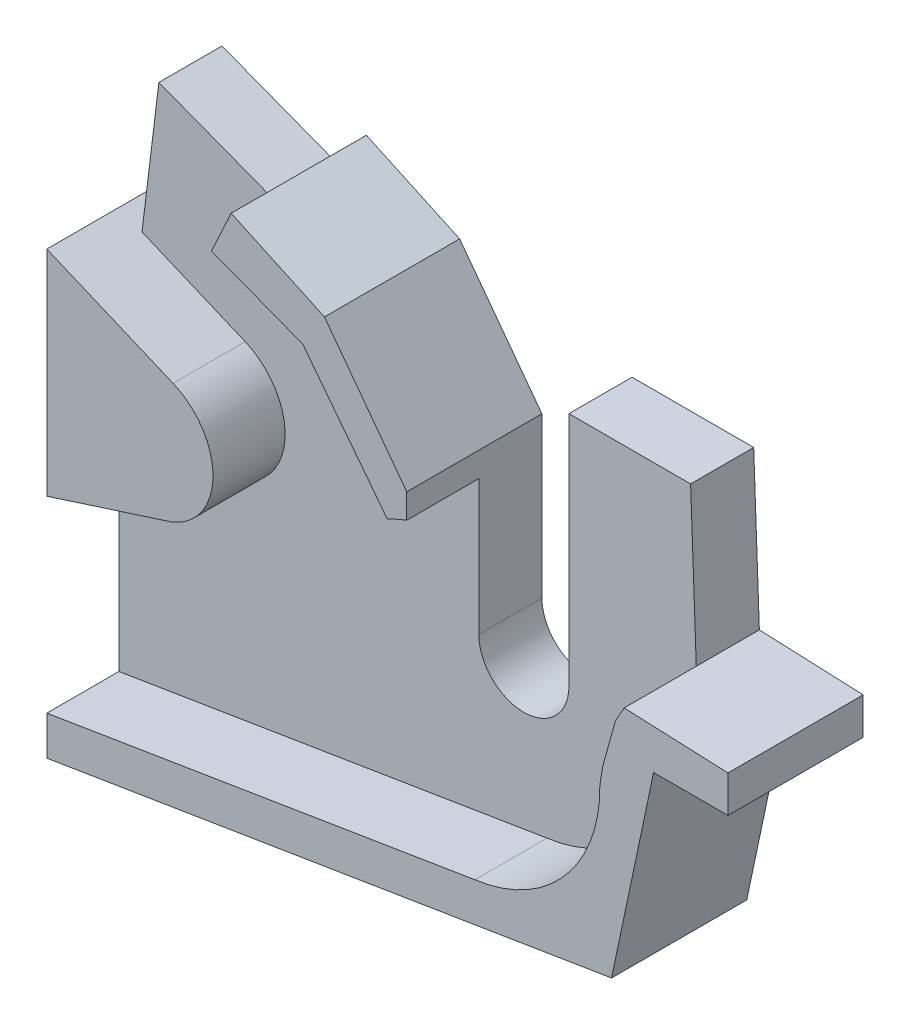
ISO-10303-21;
HEADER;
FILE_DESCRIPTION(('STEP AP214'),'2;1');
FILE_NAME('part.step','',(''),(''),'','','');
FILE_SCHEMA(('AUTOMOTIVE_DESIGN { 1 0 10303 214 1 1 1 1 }'));
ENDSEC;
DATA;
#1=APPLICATION_CONTEXT('core data for automotive mechanical design processes');
#2=APPLICATION_PROTOCOL_DEFINITION('international standard','automotive_design',2000,#1);
#3=PRODUCT_CONTEXT('',#1,'mechanical');
#4=PRODUCT('Part','Part','',(#3));
#5=PRODUCT_RELATED_PRODUCT_CATEGORY('part','',(#4));
#6=PRODUCT_DEFINITION_FORMATION('','',#4);
#7=PRODUCT_DEFINITION_CONTEXT('part definition',#1,'design');
#8=PRODUCT_DEFINITION('design','',#6,#7);
#9=PRODUCT_DEFINITION_SHAPE('','',#8);
#10=(LENGTH_UNIT() NAMED_UNIT(*) SI_UNIT(.MILLI.,.METRE.));
#11=(NAMED_UNIT(*) PLANE_ANGLE_UNIT() SI_UNIT($,.RADIAN.));
#12=(NAMED_UNIT(*) SI_UNIT($,.STERADIAN.) SOLID_ANGLE_UNIT());
#13=UNCERTAINTY_MEASURE_WITH_UNIT(LENGTH_MEASURE(1.E-05),#10,'distance_accuracy_value','');
#14=(GEOMETRIC_REPRESENTATION_CONTEXT(3) GLOBAL_UNCERTAINTY_ASSIGNED_CONTEXT((#13)) GLOBAL_UNIT_ASSIGNED_CONTEXT((#10,
#11,#12)) REPRESENTATION_CONTEXT('',''));
#15=CARTESIAN_POINT('',(0.,0.,0.));
#16=DIRECTION('',(0.,0.,1.));
#17=DIRECTION('',(1.,0.,0.));
#18=AXIS2_PLACEMENT_3D('',#15,#16,#17);
#19=CARTESIAN_POINT('',(0.,0.,7.));
#20=DIRECTION('',(0.,0.,1.));
#21=DIRECTION('',(1.,0.,0.));
#22=AXIS2_PLACEMENT_3D('',#19,#20,#21);
#23=PLANE('',#22);
#24=DIRECTION('',(-0.986991690227506,-0.160771276731423,0.));
#25=VECTOR('',#24,1.);
#26=CARTESIAN_POINT('',(2.22802353362368,-13.6780696031388,7.));
#27=LINE('',#26,#25);
#28=CARTESIAN_POINT('',(6.66593560093297,-12.9551772058192,7.));
#29=VERTEX_POINT('',#28);
#30=CARTESIAN_POINT('',(-40.8439388123938,-20.6940702911495,7.));
#31=VERTEX_POINT('',#30);
#32=EDGE_CURVE('E448',#29,#31,#27,.T.);
#33=ORIENTED_EDGE('',*,*,#32,.F.);
#34=CARTESIAN_POINT('',(4.58668043547776,2.84690158384109,7.));
#35=DIRECTION('',(0.,0.,1.));
#36=DIRECTION('',(1.,0.,0.));
#37=AXIS2_PLACEMENT_3D('',#34,#35,#36);
#38=CIRCLE('',#37,15.9382871136676);
#39=CARTESIAN_POINT('',(20.5233035123729,3.07720795083632,7.));
#40=VERTEX_POINT('',#39);
#41=EDGE_CURVE('E369',#40,#29,#38,.F.);
#42=ORIENTED_EDGE('',*,*,#41,.F.);
#43=DIRECTION('',(0.161052296150216,0.98694587384757,0.));
#44=VECTOR('',#43,1.);
#45=CARTESIAN_POINT('',(19.5018514131188,-3.18236088978088,7.));
#46=LINE('',#45,#44);
#47=CARTESIAN_POINT('',(20.8501257943456,5.0800102106292,7.));
#48=VERTEX_POINT('',#47);
#49=EDGE_CURVE('E374',#40,#48,#46,.T.);
#50=ORIENTED_EDGE('',*,*,#49,.T.);
#51=DIRECTION('',(0.268749678176345,0.963210055221659,0.));
#52=VECTOR('',#51,1.);
#53=CARTESIAN_POINT('',(18.0291728908629,-5.03040264783163,7.));
#54=LINE('',#53,#52);
#55=CARTESIAN_POINT('',(22.2571862666276,10.1229736270083,7.));
#56=VERTEX_POINT('',#55);
#57=EDGE_CURVE('E440',#48,#56,#54,.T.);
#58=ORIENTED_EDGE('',*,*,#57,.T.);
#59=DIRECTION('',(0.491293878545191,0.87099387190957,0.));
#60=VECTOR('',#59,1.);
#61=CARTESIAN_POINT('',(12.553214742302,-7.08078180324617,7.));
#62=LINE('',#61,#60);
#63=CARTESIAN_POINT('',(23.2245967998316,11.83805432074,7.));
#64=VERTEX_POINT('',#63);
#65=EDGE_CURVE('E444',#56,#64,#62,.T.);
#66=ORIENTED_EDGE('',*,*,#65,.T.);
#67=DIRECTION('',(0.0365725060444202,-0.999331002121735,0.));
#68=VECTOR('',#67,1.);
#69=CARTESIAN_POINT('',(23.6261904545896,0.864647440510251,7.));
#70=LINE('',#69,#68);
#71=CARTESIAN_POINT('',(22.5946169567633,29.0520343287084,7.));
#72=VERTEX_POINT('',#71);
#73=EDGE_CURVE('E537',#72,#64,#70,.T.);
#74=ORIENTED_EDGE('',*,*,#73,.F.);
#75=DIRECTION('',(1.,0.,0.));
#76=VECTOR('',#75,1.);
#77=CARTESIAN_POINT('',(0.,29.0520343287084,7.));
#78=LINE('',#77,#76);
#79=CARTESIAN_POINT('',(9.09461695676328,29.0520343287084,7.));
#80=VERTEX_POINT('',#79);
#81=EDGE_CURVE('E541',#80,#72,#78,.T.);
#82=ORIENTED_EDGE('',*,*,#81,.F.);
#83=DIRECTION('',(0.,1.,0.));
#84=VECTOR('',#83,1.);
#85=CARTESIAN_POINT('',(9.09461695676327,0.,7.));
#86=LINE('',#85,#84);
#87=CARTESIAN_POINT('',(9.09461695676328,2.84690158384109,7.));
#88=VERTEX_POINT('',#87);
#89=EDGE_CURVE('E546',#88,#80,#86,.T.);
#90=ORIENTED_EDGE('',*,*,#89,.F.);
#91=CARTESIAN_POINT('',(4.09461695676328,2.84690158384109,7.));
#92=DIRECTION('',(0.,0.,1.));
#93=DIRECTION('',(1.,0.,0.));
#94=AXIS2_PLACEMENT_3D('',#91,#92,#93);
#95=CIRCLE('',#94,5.);
#96=CARTESIAN_POINT('',(-0.905383043236726,2.84690158384109,7.));
#97=VERTEX_POINT('',#96);
#98=EDGE_CURVE('E550',#97,#88,#95,.T.);
#99=ORIENTED_EDGE('',*,*,#98,.F.);
#100=DIRECTION('',(0.,1.,0.));
#101=VECTOR('',#100,1.);
#102=CARTESIAN_POINT('',(-0.905383043236726,0.,7.));
#103=LINE('',#102,#101);
#104=CARTESIAN_POINT('',(-0.905383043236726,17.809061684023,7.));
#105=VERTEX_POINT('',#104);
#106=EDGE_CURVE('E554',#97,#105,#103,.T.);
#107=ORIENTED_EDGE('',*,*,#106,.T.);
#108=CARTESIAN_POINT('',(4.58668043547776,2.84690158384109,7.));
#109=DIRECTION('',(0.,0.,1.));
#110=DIRECTION('',(1.,0.,0.));
#111=AXIS2_PLACEMENT_3D('',#108,#109,#110);
#112=CIRCLE('',#111,15.9382871136676);
#113=CARTESIAN_POINT('',(-3.05448456525014,16.8340954964654,7.));
#114=VERTEX_POINT('',#113);
#115=EDGE_CURVE('E499',#114,#105,#112,.F.);
#116=ORIENTED_EDGE('',*,*,#115,.F.);
#117=DIRECTION('',(-0.612043255233143,0.790824287515007,0.));
#118=VECTOR('',#117,1.);
#119=CARTESIAN_POINT('',(6.23773255920398,4.82757320568069,7.));
#120=LINE('',#119,#118);
#121=CARTESIAN_POINT('',(-12.4513574625302,28.9758440580599,7.));
#122=VERTEX_POINT('',#121);
#123=EDGE_CURVE('E491',#114,#122,#120,.T.);
#124=ORIENTED_EDGE('',*,*,#123,.T.);
#125=DIRECTION('',(-0.934119457751685,0.356960556153896,0.));
#126=VECTOR('',#125,1.);
#127=CARTESIAN_POINT('',(8.07525317413955,21.1318897457754,7.));
#128=LINE('',#127,#126);
#129=CARTESIAN_POINT('',(-22.5723568122106,32.8434409983813,7.));
#130=VERTEX_POINT('',#129);
#131=EDGE_CURVE('E495',#122,#130,#128,.T.);
#132=ORIENTED_EDGE('',*,*,#131,.T.);
#133=DIRECTION('',(0.934119457751685,-0.356960556153896,0.));
#134=VECTOR('',#133,1.);
#135=CARTESIAN_POINT('',(8.07525317413955,21.1318897457754,7.));
#136=LINE('',#135,#134);
#137=CARTESIAN_POINT('',(-36.4119011567542,38.132027383291,7.));
#138=VERTEX_POINT('',#137);
#139=EDGE_CURVE('E558',#138,#130,#136,.T.);
#140=ORIENTED_EDGE('',*,*,#139,.F.);
#141=DIRECTION('',(0.121173466197604,0.99263134702147,0.));
#142=VECTOR('',#141,1.);
#143=CARTESIAN_POINT('',(-40.4638072950435,4.93953752337649,7.));
#144=LINE('',#143,#142);
#145=CARTESIAN_POINT('',(-38.2805029171804,22.8247762110434,7.));
#146=VERTEX_POINT('',#145);
#147=EDGE_CURVE('E562',#146,#138,#144,.T.);
#148=ORIENTED_EDGE('',*,*,#147,.F.);
#149=DIRECTION('',(-0.921598965108976,0.388143462536812,0.));
#150=VECTOR('',#149,1.);
#151=CARTESIAN_POINT('',(2.39754787859476,5.69268287882754,7.));
#152=LINE('',#151,#150);
#153=CARTESIAN_POINT('',(-26.8328210667201,18.003435216013,7.));
#154=VERTEX_POINT('',#153);
#155=EDGE_CURVE('E12',#154,#146,#152,.T.);
#156=ORIENTED_EDGE('',*,*,#155,.F.);
#157=CARTESIAN_POINT('',(-29.6416379067045,11.3342447162123,7.));
#158=DIRECTION('',(0.,0.,1.));
#159=DIRECTION('',(1.,0.,0.));
#160=AXIS2_PLACEMENT_3D('',#157,#158,#159);
#161=CIRCLE('',#160,7.2365429566342);
#162=CARTESIAN_POINT('',(-26.9614499288597,4.6123293369005,7.));
#163=VERTEX_POINT('',#162);
#164=EDGE_CURVE('E676',#154,#163,#161,.F.);
#165=ORIENTED_EDGE('',*,*,#164,.T.);
#166=DIRECTION('',(-0.951986528932336,-0.306139916919311,0.));
#167=VECTOR('',#166,1.);
#168=CARTESIAN_POINT('',(-3.87109376837225,12.0377282283499,7.));
#169=LINE('',#168,#167);
#170=CARTESIAN_POINT('',(-40.8439388123938,0.147997264675908,7.));
#171=VERTEX_POINT('',#170);
#172=EDGE_CURVE('E179',#163,#171,#169,.T.);
#173=ORIENTED_EDGE('',*,*,#172,.T.);
#174=DIRECTION('',(0.,-1.,0.));
#175=VECTOR('',#174,1.);
#176=CARTESIAN_POINT('',(-40.8439388123938,0.,7.));
#177=LINE('',#176,#175);
#178=EDGE_CURVE('E565',#171,#31,#177,.T.);
#179=ORIENTED_EDGE('',*,*,#178,.T.);
#180=EDGE_LOOP('',(#33,#42,#50,#58,#66,#74,#82,#90,#99,#107,#116,#124,#132,#140,#148,#156,#165,
#173,#179));
#181=FACE_BOUND('',#180,.T.);
#182=ADVANCED_FACE('F170',(#181),#23,.T.);
#183=CARTESIAN_POINT('',(23.6261904545896,0.864647440510251,7.));
#184=DIRECTION('',(0.999331002121735,0.0365725060444202,0.));
#185=DIRECTION('',(-0.0365725060444202,0.999331002121735,0.));
#186=AXIS2_PLACEMENT_3D('',#183,#184,#185);
#187=PLANE('',#186);
#188=DIRECTION('',(0.0365725060444202,-0.999331002121735,0.));
#189=VECTOR('',#188,1.);
#190=CARTESIAN_POINT('',(23.6261904545896,0.864647440510251,0.));
#191=LINE('',#190,#189);
#192=CARTESIAN_POINT('',(22.5946169567633,29.0520343287084,0.));
#193=VERTEX_POINT('',#192);
#194=CARTESIAN_POINT('',(23.2245967998316,11.83805432074,0.));
#195=VERTEX_POINT('',#194);
#196=EDGE_CURVE('E573',#193,#195,#191,.T.);
#197=ORIENTED_EDGE('',*,*,#196,.F.);
#198=DIRECTION('',(0.,0.,-1.));
#199=VECTOR('',#198,1.);
#200=CARTESIAN_POINT('',(22.5946169567633,29.0520343287084,7.));
#201=LINE('',#200,#199);
#202=EDGE_CURVE('E670',#72,#193,#201,.T.);
#203=ORIENTED_EDGE('',*,*,#202,.F.);
#204=ORIENTED_EDGE('',*,*,#73,.T.);
#205=DIRECTION('',(0.,0.,-1.));
#206=VECTOR('',#205,1.);
#207=CARTESIAN_POINT('',(23.2245967998316,11.83805432074,7.));
#208=LINE('',#207,#206);
#209=EDGE_CURVE('E673',#64,#195,#208,.T.);
#210=ORIENTED_EDGE('',*,*,#209,.T.);
#211=EDGE_LOOP('',(#197,#203,#204,#210));
#212=FACE_BOUND('',#211,.T.);
#213=ADVANCED_FACE('F788',(#212),#187,.T.);
#214=CARTESIAN_POINT('',(0.,29.0520343287084,7.));
#215=DIRECTION('',(0.,1.,0.));
#216=DIRECTION('',(0.,0.,1.));
#217=AXIS2_PLACEMENT_3D('',#214,#215,#216);
#218=PLANE('',#217);
#219=DIRECTION('',(1.,0.,0.));
#220=VECTOR('',#219,1.);
#221=CARTESIAN_POINT('',(0.,29.0520343287084,0.));
#222=LINE('',#221,#220);
#223=CARTESIAN_POINT('',(9.09461695676328,29.0520343287084,0.));
#224=VERTEX_POINT('',#223);
#225=EDGE_CURVE('E577',#224,#193,#222,.T.);
#226=ORIENTED_EDGE('',*,*,#225,.F.);
#227=DIRECTION('',(0.,0.,-1.));
#228=VECTOR('',#227,1.);
#229=CARTESIAN_POINT('',(9.09461695676328,29.0520343287084,7.));
#230=LINE('',#229,#228);
#231=EDGE_CURVE('E667',#80,#224,#230,.T.);
#232=ORIENTED_EDGE('',*,*,#231,.F.);
#233=ORIENTED_EDGE('',*,*,#81,.T.);
#234=ORIENTED_EDGE('',*,*,#202,.T.);
#235=EDGE_LOOP('',(#226,#232,#233,#234));
#236=FACE_BOUND('',#235,.T.);
#237=ADVANCED_FACE('F728',(#236),#218,.T.);
#238=CARTESIAN_POINT('',(9.09461695676327,0.,7.));
#239=DIRECTION('',(-1.,0.,0.));
#240=DIRECTION('',(0.,-1.,0.));
#241=AXIS2_PLACEMENT_3D('',#238,#239,#240);
#242=PLANE('',#241);
#243=DIRECTION('',(0.,1.,0.));
#244=VECTOR('',#243,1.);
#245=CARTESIAN_POINT('',(9.09461695676327,0.,0.));
#246=LINE('',#245,#244);
#247=CARTESIAN_POINT('',(9.09461695676328,2.84690158384109,0.));
#248=VERTEX_POINT('',#247);
#249=EDGE_CURVE('E581',#248,#224,#246,.T.);
#250=ORIENTED_EDGE('',*,*,#249,.F.);
#251=DIRECTION('',(0.,0.,-1.));
#252=VECTOR('',#251,1.);
#253=CARTESIAN_POINT('',(9.09461695676328,2.84690158384109,7.));
#254=LINE('',#253,#252);
#255=EDGE_CURVE('E664',#88,#248,#254,.T.);
#256=ORIENTED_EDGE('',*,*,#255,.F.);
#257=ORIENTED_EDGE('',*,*,#89,.T.);
#258=ORIENTED_EDGE('',*,*,#231,.T.);
#259=EDGE_LOOP('',(#250,#256,#257,#258));
#260=FACE_BOUND('',#259,.T.);
#261=ADVANCED_FACE('F732',(#260),#242,.T.);
#262=CARTESIAN_POINT('',(4.09461695676328,2.84690158384109,7.));
#263=DIRECTION('',(0.,0.,-1.));
#264=DIRECTION('',(-1.,0.,0.));
#265=AXIS2_PLACEMENT_3D('',#262,#263,#264);
#266=CYLINDRICAL_SURFACE('',#265,5.);
#267=CARTESIAN_POINT('',(4.09461695676328,2.84690158384109,0.));
#268=DIRECTION('',(0.,0.,1.));
#269=DIRECTION('',(1.,0.,0.));
#270=AXIS2_PLACEMENT_3D('',#267,#268,#269);
#271=CIRCLE('',#270,5.);
#272=CARTESIAN_POINT('',(-0.905383043236726,2.84690158384109,0.));
#273=VERTEX_POINT('',#272);
#274=EDGE_CURVE('E585',#273,#248,#271,.T.);
#275=ORIENTED_EDGE('',*,*,#274,.F.);
#276=DIRECTION('',(0.,0.,-1.));
#277=VECTOR('',#276,1.);
#278=CARTESIAN_POINT('',(-0.905383043236726,2.84690158384109,7.));
#279=LINE('',#278,#277);
#280=EDGE_CURVE('E661',#97,#273,#279,.T.);
#281=ORIENTED_EDGE('',*,*,#280,.F.);
#282=ORIENTED_EDGE('',*,*,#98,.T.);
#283=ORIENTED_EDGE('',*,*,#255,.T.);
#284=EDGE_LOOP('',(#275,#281,#282,#283));
#285=FACE_BOUND('',#284,.T.);
#286=ADVANCED_FACE('F736',(#285),#266,.F.);
#287=CARTESIAN_POINT('',(-0.905383043236726,0.,7.));
#288=DIRECTION('',(-1.,0.,0.));
#289=DIRECTION('',(0.,0.,1.));
#290=AXIS2_PLACEMENT_3D('',#287,#288,#289);
#291=PLANE('',#290);
#292=DIRECTION('',(0.,1.,0.));
#293=VECTOR('',#292,1.);
#294=CARTESIAN_POINT('',(-0.905383043236726,0.,0.));
#295=LINE('',#294,#293);
#296=CARTESIAN_POINT('',(-0.905383043236726,20.5391363305154,0.));
#297=VERTEX_POINT('',#296);
#298=EDGE_CURVE('E589',#273,#297,#295,.T.);
#299=ORIENTED_EDGE('',*,*,#298,.T.);
#300=DIRECTION('',(0.,0.,-1.));
#301=VECTOR('',#300,1.);
#302=CARTESIAN_POINT('',(-0.905383043236726,20.5391363305154,7.));
#303=LINE('',#302,#301);
#304=CARTESIAN_POINT('',(-0.905383043236726,20.5391363305154,15.));
#305=VERTEX_POINT('',#304);
#306=EDGE_CURVE('E657',#305,#297,#303,.T.);
#307=ORIENTED_EDGE('',*,*,#306,.F.);
#308=DIRECTION('',(0.,1.,0.));
#309=VECTOR('',#308,1.);
#310=CARTESIAN_POINT('',(-0.905383043236726,0.,15.));
#311=LINE('',#310,#309);
#312=CARTESIAN_POINT('',(-0.905383043236726,17.809061684023,15.));
#313=VERTEX_POINT('',#312);
#314=EDGE_CURVE('E457',#313,#305,#311,.T.);
#315=ORIENTED_EDGE('',*,*,#314,.F.);
#316=DIRECTION('',(0.,0.,-1.));
#317=VECTOR('',#316,1.);
#318=CARTESIAN_POINT('',(-0.905383043236726,17.809061684023,15.));
#319=LINE('',#318,#317);
#320=EDGE_CURVE('E487',#313,#105,#319,.T.);
#321=ORIENTED_EDGE('',*,*,#320,.T.);
#322=ORIENTED_EDGE('',*,*,#106,.F.);
#323=ORIENTED_EDGE('',*,*,#280,.T.);
#324=EDGE_LOOP('',(#299,#307,#315,#321,#322,#323));
#325=FACE_BOUND('',#324,.T.);
#326=ADVANCED_FACE('F740',(#325),#291,.F.);
#327=CARTESIAN_POINT('',(9.26114189402648,6.90647430874386,7.));
#328=DIRECTION('',(-0.801633281882219,-0.597816093275133,0.));
#329=DIRECTION('',(0.597816093275133,-0.801633281882219,0.));
#330=AXIS2_PLACEMENT_3D('',#327,#328,#329);
#331=PLANE('',#330);
#332=DIRECTION('',(-0.597816093275133,0.801633281882219,0.));
#333=VECTOR('',#332,1.);
#334=CARTESIAN_POINT('',(9.26114189402648,6.90647430874386,0.));
#335=LINE('',#334,#333);
#336=CARTESIAN_POINT('',(-10.0368202056355,32.7838116129957,0.));
#337=VERTEX_POINT('',#336);
#338=EDGE_CURVE('E592',#297,#337,#335,.T.);
#339=ORIENTED_EDGE('',*,*,#338,.T.);
#340=DIRECTION('',(0.,0.,-1.));
#341=VECTOR('',#340,1.);
#342=CARTESIAN_POINT('',(-10.0368202056355,32.7838116129957,7.));
#343=LINE('',#342,#341);
#344=CARTESIAN_POINT('',(-10.0368202056355,32.7838116129957,15.));
#345=VERTEX_POINT('',#344);
#346=EDGE_CURVE('E653',#345,#337,#343,.T.);
#347=ORIENTED_EDGE('',*,*,#346,.F.);
#348=DIRECTION('',(-0.597816093275133,0.801633281882219,0.));
#349=VECTOR('',#348,1.);
#350=CARTESIAN_POINT('',(9.26114189402648,6.90647430874386,15.));
#351=LINE('',#350,#349);
#352=EDGE_CURVE('E461',#305,#345,#351,.T.);
#353=ORIENTED_EDGE('',*,*,#352,.F.);
#354=ORIENTED_EDGE('',*,*,#306,.T.);
#355=EDGE_LOOP('',(#339,#347,#353,#354));
#356=FACE_BOUND('',#355,.T.);
#357=ADVANCED_FACE('F787',(#356),#331,.F.);
#358=CARTESIAN_POINT('',(10.7214720768776,23.1841900245257,7.));
#359=DIRECTION('',(-0.419738295272975,-0.907645174879114,0.));
#360=DIRECTION('',(0.907645174879114,-0.419738295272975,0.));
#361=AXIS2_PLACEMENT_3D('',#358,#359,#360);
#362=PLANE('',#361);
#363=DIRECTION('',(-0.907645174879114,0.419738295272975,0.));
#364=VECTOR('',#363,1.);
#365=CARTESIAN_POINT('',(10.7214720768776,23.1841900245257,0.));
#366=LINE('',#365,#364);
#367=CARTESIAN_POINT('',(-20.3865602199569,37.5700236156193,0.));
#368=VERTEX_POINT('',#367);
#369=EDGE_CURVE('E595',#337,#368,#366,.T.);
#370=ORIENTED_EDGE('',*,*,#369,.T.);
#371=DIRECTION('',(0.,0.,-1.));
#372=VECTOR('',#371,1.);
#373=CARTESIAN_POINT('',(-20.3865602199569,37.5700236156193,7.));
#374=LINE('',#373,#372);
#375=CARTESIAN_POINT('',(-20.3865602199569,37.5700236156193,15.));
#376=VERTEX_POINT('',#375);
#377=EDGE_CURVE('E649',#376,#368,#374,.T.);
#378=ORIENTED_EDGE('',*,*,#377,.F.);
#379=DIRECTION('',(-0.907645174879114,0.419738295272975,0.));
#380=VECTOR('',#379,1.);
#381=CARTESIAN_POINT('',(10.7214720768776,23.1841900245257,15.));
#382=LINE('',#381,#380);
#383=EDGE_CURVE('E465',#345,#376,#382,.T.);
#384=ORIENTED_EDGE('',*,*,#383,.F.);
#385=ORIENTED_EDGE('',*,*,#346,.T.);
#386=EDGE_LOOP('',(#370,#378,#384,#385));
#387=FACE_BOUND('',#386,.T.);
#388=ADVANCED_FACE('F783',(#387),#362,.F.);
#389=CARTESIAN_POINT('',(-31.1080322968345,14.3858335910936,7.));
#390=DIRECTION('',(0.907645174879114,-0.419738295272975,0.));
#391=DIRECTION('',(0.419738295272975,0.907645174879114,0.));
#392=AXIS2_PLACEMENT_3D('',#389,#390,#391);
#393=PLANE('',#392);
#394=DIRECTION('',(-0.419738295272975,-0.907645174879114,0.));
#395=VECTOR('',#394,1.);
#396=CARTESIAN_POINT('',(-31.1080322968345,14.3858335910936,0.));
#397=LINE('',#396,#395);
#398=CARTESIAN_POINT('',(-22.5723568122107,32.8434409983813,0.));
#399=VERTEX_POINT('',#398);
#400=EDGE_CURVE('E598',#368,#399,#397,.T.);
#401=ORIENTED_EDGE('',*,*,#400,.T.);
#402=DIRECTION('',(0.,0.,-1.));
#403=VECTOR('',#402,1.);
#404=CARTESIAN_POINT('',(-22.5723568122107,32.8434409983813,7.));
#405=LINE('',#404,#403);
#406=EDGE_CURVE('E646',#130,#399,#405,.T.);
#407=ORIENTED_EDGE('',*,*,#406,.F.);
#408=DIRECTION('',(0.,0.,-1.));
#409=VECTOR('',#408,1.);
#410=CARTESIAN_POINT('',(-22.5723568122106,32.8434409983813,15.));
#411=LINE('',#410,#409);
#412=CARTESIAN_POINT('',(-22.5723568122106,32.8434409983813,15.));
#413=VERTEX_POINT('',#412);
#414=EDGE_CURVE('E484',#413,#130,#411,.T.);
#415=ORIENTED_EDGE('',*,*,#414,.F.);
#416=DIRECTION('',(-0.419738295272975,-0.907645174879114,0.));
#417=VECTOR('',#416,1.);
#418=CARTESIAN_POINT('',(-31.1080322968345,14.3858335910936,15.));
#419=LINE('',#418,#417);
#420=EDGE_CURVE('E469',#376,#413,#419,.T.);
#421=ORIENTED_EDGE('',*,*,#420,.F.);
#422=ORIENTED_EDGE('',*,*,#377,.T.);
#423=EDGE_LOOP('',(#401,#407,#415,#421,#422));
#424=FACE_BOUND('',#423,.T.);
#425=ADVANCED_FACE('F759',(#424),#393,.F.);
#426=CARTESIAN_POINT('',(8.07525317413955,21.1318897457754,7.));
#427=DIRECTION('',(0.356960556153896,0.934119457751685,0.));
#428=DIRECTION('',(-0.934119457751685,0.356960556153896,0.));
#429=AXIS2_PLACEMENT_3D('',#426,#427,#428);
#430=PLANE('',#429);
#431=DIRECTION('',(0.934119457751685,-0.356960556153896,0.));
#432=VECTOR('',#431,1.);
#433=CARTESIAN_POINT('',(8.07525317413955,21.1318897457754,0.));
#434=LINE('',#433,#432);
#435=CARTESIAN_POINT('',(-36.4119011567542,38.132027383291,0.));
#436=VERTEX_POINT('',#435);
#437=EDGE_CURVE('E602',#436,#399,#434,.T.);
#438=ORIENTED_EDGE('',*,*,#437,.F.);
#439=DIRECTION('',(0.,0.,-1.));
#440=VECTOR('',#439,1.);
#441=CARTESIAN_POINT('',(-36.4119011567542,38.132027383291,7.));
#442=LINE('',#441,#440);
#443=EDGE_CURVE('E642',#138,#436,#442,.T.);
#444=ORIENTED_EDGE('',*,*,#443,.F.);
#445=ORIENTED_EDGE('',*,*,#139,.T.);
#446=ORIENTED_EDGE('',*,*,#406,.T.);
#447=EDGE_LOOP('',(#438,#444,#445,#446));
#448=FACE_BOUND('',#447,.T.);
#449=ADVANCED_FACE('F764',(#448),#430,.T.);
#450=CARTESIAN_POINT('',(-40.4638072950435,4.93953752337649,7.));
#451=DIRECTION('',(-0.99263134702147,0.121173466197604,0.));
#452=DIRECTION('',(-0.121173466197604,-0.99263134702147,0.));
#453=AXIS2_PLACEMENT_3D('',#450,#451,#452);
#454=PLANE('',#453);
#455=DIRECTION('',(0.,0.,-1.));
#456=VECTOR('',#455,1.);
#457=CARTESIAN_POINT('',(-38.2805029171804,22.8247762110434,7.));
#458=LINE('',#457,#456);
#459=CARTESIAN_POINT('',(-38.2805029171804,22.8247762110434,0.));
#460=VERTEX_POINT('',#459);
#461=EDGE_CURVE('E533',#146,#460,#458,.T.);
#462=ORIENTED_EDGE('',*,*,#461,.F.);
#463=ORIENTED_EDGE('',*,*,#147,.T.);
#464=ORIENTED_EDGE('',*,*,#443,.T.);
#465=DIRECTION('',(0.121173466197604,0.99263134702147,0.));
#466=VECTOR('',#465,1.);
#467=CARTESIAN_POINT('',(-40.4638072950435,4.93953752337649,0.));
#468=LINE('',#467,#466);
#469=EDGE_CURVE('E606',#460,#436,#468,.T.);
#470=ORIENTED_EDGE('',*,*,#469,.F.);
#471=EDGE_LOOP('',(#462,#463,#464,#470));
#472=FACE_BOUND('',#471,.T.);
#473=ADVANCED_FACE('F768',(#472),#454,.T.);
#474=CARTESIAN_POINT('',(-40.8439388123938,0.,7.));
#475=DIRECTION('',(1.,0.,0.));
#476=DIRECTION('',(0.,0.,-1.));
#477=AXIS2_PLACEMENT_3D('',#474,#475,#476);
#478=PLANE('',#477);
#479=DIRECTION('',(0.,-1.,0.));
#480=VECTOR('',#479,1.);
#481=CARTESIAN_POINT('',(-40.8439388123938,0.,0.));
#482=LINE('',#481,#480);
#483=CARTESIAN_POINT('',(-40.8439388123938,23.9044007788093,0.));
#484=VERTEX_POINT('',#483);
#485=CARTESIAN_POINT('',(-40.8439388123938,-25.025296529904,0.));
#486=VERTEX_POINT('',#485);
#487=EDGE_CURVE('E609',#484,#486,#482,.T.);
#488=ORIENTED_EDGE('',*,*,#487,.T.);
#489=DIRECTION('',(0.,0.,-1.));
#490=VECTOR('',#489,1.);
#491=CARTESIAN_POINT('',(-40.8439388123938,-25.025296529904,7.));
#492=LINE('',#491,#490);
#493=CARTESIAN_POINT('',(-40.8439388123938,-25.025296529904,15.));
#494=VERTEX_POINT('',#493);
#495=EDGE_CURVE('E638',#494,#486,#492,.T.);
#496=ORIENTED_EDGE('',*,*,#495,.F.);
#497=DIRECTION('',(0.,-1.,0.));
#498=VECTOR('',#497,1.);
#499=CARTESIAN_POINT('',(-40.8439388123938,0.,15.));
#500=LINE('',#499,#498);
#501=CARTESIAN_POINT('',(-40.8439388123938,-20.6940702911495,15.));
#502=VERTEX_POINT('',#501);
#503=EDGE_CURVE('E390',#502,#494,#500,.T.);
#504=ORIENTED_EDGE('',*,*,#503,.F.);
#505=DIRECTION('',(0.,0.,-1.));
#506=VECTOR('',#505,1.);
#507=CARTESIAN_POINT('',(-40.8439388123938,-20.6940702911495,15.));
#508=LINE('',#507,#506);
#509=EDGE_CURVE('E375',#502,#31,#508,.T.);
#510=ORIENTED_EDGE('',*,*,#509,.T.);
#511=ORIENTED_EDGE('',*,*,#178,.F.);
#512=DIRECTION('',(0.,0.,-1.));
#513=VECTOR('',#512,1.);
#514=CARTESIAN_POINT('',(-40.8439388123938,0.147997264675908,15.));
#515=LINE('',#514,#513);
#516=CARTESIAN_POINT('',(-40.8439388123938,0.147997264675908,15.));
#517=VERTEX_POINT('',#516);
#518=EDGE_CURVE('E526',#517,#171,#515,.T.);
#519=ORIENTED_EDGE('',*,*,#518,.F.);
#520=DIRECTION('',(0.,-1.,0.));
#521=VECTOR('',#520,1.);
#522=CARTESIAN_POINT('',(-40.8439388123938,0.,15.));
#523=LINE('',#522,#521);
#524=CARTESIAN_POINT('',(-40.8439388123938,23.9044007788093,15.));
#525=VERTEX_POINT('',#524);
#526=EDGE_CURVE('E507',#525,#517,#523,.T.);
#527=ORIENTED_EDGE('',*,*,#526,.F.);
#528=DIRECTION('',(0.,0.,-1.));
#529=VECTOR('',#528,1.);
#530=CARTESIAN_POINT('',(-40.8439388123938,23.9044007788093,15.));
#531=LINE('',#530,#529);
#532=EDGE_CURVE('E529',#525,#484,#531,.T.);
#533=ORIENTED_EDGE('',*,*,#532,.T.);
#534=EDGE_LOOP('',(#488,#496,#504,#510,#511,#519,#527,#533));
#535=FACE_BOUND('',#534,.T.);
#536=ADVANCED_FACE('F689',(#535),#478,.F.);
#537=CARTESIAN_POINT('',(2.9153021414019,-17.8973448899889,7.));
#538=DIRECTION('',(-0.160771276731423,0.986991690227506,0.));
#539=DIRECTION('',(-0.986991690227506,-0.160771276731423,0.));
#540=AXIS2_PLACEMENT_3D('',#537,#538,#539);
#541=PLANE('',#540);
#542=DIRECTION('',(0.986991690227506,0.160771276731423,0.));
#543=VECTOR('',#542,1.);
#544=CARTESIAN_POINT('',(2.9153021414019,-17.8973448899889,0.));
#545=LINE('',#544,#543);
#546=CARTESIAN_POINT('',(21.8226728247008,-14.8175194421297,0.));
#547=VERTEX_POINT('',#546);
#548=EDGE_CURVE('E612',#486,#547,#545,.T.);
#549=ORIENTED_EDGE('',*,*,#548,.T.);
#550=DIRECTION('',(0.,0.,-1.));
#551=VECTOR('',#550,1.);
#552=CARTESIAN_POINT('',(21.8226728247008,-14.8175194421297,7.));
#553=LINE('',#552,#551);
#554=CARTESIAN_POINT('',(21.8226728247008,-14.8175194421297,15.));
#555=VERTEX_POINT('',#554);
#556=EDGE_CURVE('E634',#555,#547,#553,.T.);
#557=ORIENTED_EDGE('',*,*,#556,.F.);
#558=DIRECTION('',(0.986991690227506,0.160771276731423,0.));
#559=VECTOR('',#558,1.);
#560=CARTESIAN_POINT('',(2.9153021414019,-17.8973448899889,15.));
#561=LINE('',#560,#559);
#562=EDGE_CURVE('E393',#494,#555,#561,.T.);
#563=ORIENTED_EDGE('',*,*,#562,.F.);
#564=ORIENTED_EDGE('',*,*,#495,.T.);
#565=EDGE_LOOP('',(#549,#557,#563,#564));
#566=FACE_BOUND('',#565,.T.);
#567=ADVANCED_FACE('F695',(#566),#541,.F.);
#568=CARTESIAN_POINT('',(23.8872555836264,-5.04814442659853,7.));
#569=DIRECTION('',(-0.97839056027552,0.206765353876691,0.));
#570=DIRECTION('',(-0.206765353876691,-0.97839056027552,0.));
#571=AXIS2_PLACEMENT_3D('',#568,#569,#570);
#572=PLANE('',#571);
#573=DIRECTION('',(0.206765353876691,0.97839056027552,0.));
#574=VECTOR('',#573,1.);
#575=CARTESIAN_POINT('',(23.8872555836264,-5.04814442659853,0.));
#576=LINE('',#575,#574);
#577=CARTESIAN_POINT('',(26.4898011963491,7.26681072634678,0.));
#578=VERTEX_POINT('',#577);
#579=EDGE_CURVE('E615',#547,#578,#576,.T.);
#580=ORIENTED_EDGE('',*,*,#579,.T.);
#581=DIRECTION('',(0.,0.,-1.));
#582=VECTOR('',#581,1.);
#583=CARTESIAN_POINT('',(26.4898011963491,7.26681072634678,7.));
#584=LINE('',#583,#582);
#585=CARTESIAN_POINT('',(26.4898011963491,7.26681072634678,15.));
#586=VERTEX_POINT('',#585);
#587=EDGE_CURVE('E630',#586,#578,#584,.T.);
#588=ORIENTED_EDGE('',*,*,#587,.F.);
#589=DIRECTION('',(0.206765353876691,0.97839056027552,0.));
#590=VECTOR('',#589,1.);
#591=CARTESIAN_POINT('',(23.8872555836264,-5.04814442659853,15.));
#592=LINE('',#591,#590);
#593=EDGE_CURVE('E399',#555,#586,#592,.T.);
#594=ORIENTED_EDGE('',*,*,#593,.F.);
#595=ORIENTED_EDGE('',*,*,#556,.T.);
#596=EDGE_LOOP('',(#580,#588,#594,#595));
#597=FACE_BOUND('',#596,.T.);
#598=ADVANCED_FACE('F699',(#597),#572,.F.);
#599=CARTESIAN_POINT('',(0.,7.26681072634678,7.));
#600=DIRECTION('',(0.,1.,0.));
#601=DIRECTION('',(0.,0.,1.));
#602=AXIS2_PLACEMENT_3D('',#599,#600,#601);
#603=PLANE('',#602);
#604=DIRECTION('',(1.,0.,0.));
#605=VECTOR('',#604,1.);
#606=CARTESIAN_POINT('',(0.,7.26681072634678,0.));
#607=LINE('',#606,#605);
#608=CARTESIAN_POINT('',(34.744303122736,7.26681072634678,0.));
#609=VERTEX_POINT('',#608);
#610=EDGE_CURVE('E618',#578,#609,#607,.T.);
#611=ORIENTED_EDGE('',*,*,#610,.T.);
#612=DIRECTION('',(0.,0.,-1.));
#613=VECTOR('',#612,1.);
#614=CARTESIAN_POINT('',(34.744303122736,7.26681072634678,7.));
#615=LINE('',#614,#613);
#616=CARTESIAN_POINT('',(34.744303122736,7.26681072634678,15.));
#617=VERTEX_POINT('',#616);
#618=EDGE_CURVE('E626',#617,#609,#615,.T.);
#619=ORIENTED_EDGE('',*,*,#618,.F.);
#620=DIRECTION('',(1.,0.,0.));
#621=VECTOR('',#620,1.);
#622=CARTESIAN_POINT('',(0.,7.26681072634678,15.));
#623=LINE('',#622,#621);
#624=EDGE_CURVE('E403',#586,#617,#623,.T.);
#625=ORIENTED_EDGE('',*,*,#624,.F.);
#626=ORIENTED_EDGE('',*,*,#587,.T.);
#627=EDGE_LOOP('',(#611,#619,#625,#626));
#628=FACE_BOUND('',#627,.T.);
#629=ADVANCED_FACE('F705',(#628),#603,.F.);
#630=CARTESIAN_POINT('',(34.744303122736,0.,7.));
#631=DIRECTION('',(-1.,0.,0.));
#632=DIRECTION('',(0.,0.,1.));
#633=AXIS2_PLACEMENT_3D('',#630,#631,#632);
#634=PLANE('',#633);
#635=DIRECTION('',(0.,1.,0.));
#636=VECTOR('',#635,1.);
#637=CARTESIAN_POINT('',(34.744303122736,0.,0.));
#638=LINE('',#637,#636);
#639=CARTESIAN_POINT('',(34.744303122736,11.3546415658289,0.));
#640=VERTEX_POINT('',#639);
#641=EDGE_CURVE('E542',#609,#640,#638,.T.);
#642=ORIENTED_EDGE('',*,*,#641,.T.);
#643=DIRECTION('',(0.,0.,-1.));
#644=VECTOR('',#643,1.);
#645=CARTESIAN_POINT('',(34.744303122736,11.3546415658289,7.));
#646=LINE('',#645,#644);
#647=CARTESIAN_POINT('',(34.744303122736,11.3546415658289,15.));
#648=VERTEX_POINT('',#647);
#649=EDGE_CURVE('E569',#648,#640,#646,.T.);
#650=ORIENTED_EDGE('',*,*,#649,.F.);
#651=DIRECTION('',(0.,1.,0.));
#652=VECTOR('',#651,1.);
#653=CARTESIAN_POINT('',(34.744303122736,0.,15.));
#654=LINE('',#653,#652);
#655=EDGE_CURVE('E407',#617,#648,#654,.T.);
#656=ORIENTED_EDGE('',*,*,#655,.F.);
#657=ORIENTED_EDGE('',*,*,#618,.T.);
#658=EDGE_LOOP('',(#642,#650,#656,#657));
#659=FACE_BOUND('',#658,.T.);
#660=ADVANCED_FACE('F709',(#659),#634,.F.);
#661=CARTESIAN_POINT('',(0.536724699134198,12.7901277892678,7.));
#662=DIRECTION('',(0.0419270824807038,0.999120673269579,0.));
#663=DIRECTION('',(-0.999120673269579,0.0419270824807038,0.));
#664=AXIS2_PLACEMENT_3D('',#661,#662,#663);
#665=PLANE('',#664);
#666=DIRECTION('',(0.999120673269579,-0.0419270824807038,0.));
#667=VECTOR('',#666,1.);
#668=CARTESIAN_POINT('',(0.536724699134198,12.7901277892678,0.));
#669=LINE('',#668,#667);
#670=EDGE_CURVE('E536',#195,#640,#669,.T.);
#671=ORIENTED_EDGE('',*,*,#670,.F.);
#672=ORIENTED_EDGE('',*,*,#209,.F.);
#673=DIRECTION('',(0.,0.,-1.));
#674=VECTOR('',#673,1.);
#675=CARTESIAN_POINT('',(23.2245967998316,11.83805432074,15.));
#676=LINE('',#675,#674);
#677=CARTESIAN_POINT('',(23.2245967998316,11.83805432074,15.));
#678=VERTEX_POINT('',#677);
#679=EDGE_CURVE('E432',#678,#64,#676,.T.);
#680=ORIENTED_EDGE('',*,*,#679,.F.);
#681=DIRECTION('',(0.999120673269579,-0.0419270824807038,0.));
#682=VECTOR('',#681,1.);
#683=CARTESIAN_POINT('',(0.536724699134198,12.7901277892678,15.));
#684=LINE('',#683,#682);
#685=EDGE_CURVE('E411',#678,#648,#684,.T.);
#686=ORIENTED_EDGE('',*,*,#685,.T.);
#687=ORIENTED_EDGE('',*,*,#649,.T.);
#688=EDGE_LOOP('',(#671,#672,#680,#686,#687));
#689=FACE_BOUND('',#688,.T.);
#690=ADVANCED_FACE('F172',(#689),#665,.T.);
#691=CARTESIAN_POINT('',(0.,0.,0.));
#692=DIRECTION('',(0.,0.,1.));
#693=DIRECTION('',(1.,0.,0.));
#694=AXIS2_PLACEMENT_3D('',#691,#692,#693);
#695=PLANE('',#694);
#696=ORIENTED_EDGE('',*,*,#548,.F.);
#697=ORIENTED_EDGE('',*,*,#487,.F.);
#698=DIRECTION('',(0.921598965108976,-0.388143462536812,0.));
#699=VECTOR('',#698,1.);
#700=CARTESIAN_POINT('',(2.39754787859476,5.69268287882754,0.));
#701=LINE('',#700,#699);
#702=EDGE_CURVE('E502',#484,#460,#701,.T.);
#703=ORIENTED_EDGE('',*,*,#702,.T.);
#704=ORIENTED_EDGE('',*,*,#469,.T.);
#705=ORIENTED_EDGE('',*,*,#437,.T.);
#706=ORIENTED_EDGE('',*,*,#400,.F.);
#707=ORIENTED_EDGE('',*,*,#369,.F.);
#708=ORIENTED_EDGE('',*,*,#338,.F.);
#709=ORIENTED_EDGE('',*,*,#298,.F.);
#710=ORIENTED_EDGE('',*,*,#274,.T.);
#711=ORIENTED_EDGE('',*,*,#249,.T.);
#712=ORIENTED_EDGE('',*,*,#225,.T.);
#713=ORIENTED_EDGE('',*,*,#196,.T.);
#714=ORIENTED_EDGE('',*,*,#670,.T.);
#715=ORIENTED_EDGE('',*,*,#641,.F.);
#716=ORIENTED_EDGE('',*,*,#610,.F.);
#717=ORIENTED_EDGE('',*,*,#579,.F.);
#718=EDGE_LOOP('',(#696,#697,#703,#704,#705,#706,#707,#708,#709,#710,#711,#712,#713,#714,#715,
#716,#717));
#719=FACE_BOUND('',#718,.T.);
#720=ADVANCED_FACE('F702',(#719),#695,.F.);
#721=CARTESIAN_POINT('',(2.39754787859476,5.69268287882754,15.));
#722=DIRECTION('',(0.388143462536812,0.921598965108975,0.));
#723=DIRECTION('',(-0.921598965108976,0.388143462536812,0.));
#724=AXIS2_PLACEMENT_3D('',#721,#722,#723);
#725=PLANE('',#724);
#726=ORIENTED_EDGE('',*,*,#155,.T.);
#727=ORIENTED_EDGE('',*,*,#461,.T.);
#728=ORIENTED_EDGE('',*,*,#702,.F.);
#729=ORIENTED_EDGE('',*,*,#532,.F.);
#730=DIRECTION('',(0.921598965108976,-0.388143462536812,0.));
#731=VECTOR('',#730,1.);
#732=CARTESIAN_POINT('',(2.39754787859476,5.69268287882754,15.));
#733=LINE('',#732,#731);
#734=CARTESIAN_POINT('',(-26.8328210667201,18.003435216013,15.));
#735=VERTEX_POINT('',#734);
#736=EDGE_CURVE('E503',#525,#735,#733,.T.);
#737=ORIENTED_EDGE('',*,*,#736,.T.);
#738=DIRECTION('',(0.,0.,-1.));
#739=VECTOR('',#738,1.);
#740=CARTESIAN_POINT('',(-26.8328210667201,18.003435216013,15.));
#741=LINE('',#740,#739);
#742=EDGE_CURVE('E516',#735,#154,#741,.T.);
#743=ORIENTED_EDGE('',*,*,#742,.T.);
#744=EDGE_LOOP('',(#726,#727,#728,#729,#737,#743));
#745=FACE_BOUND('',#744,.T.);
#746=ADVANCED_FACE('F770',(#745),#725,.T.);
#747=CARTESIAN_POINT('',(-3.87109376837225,12.0377282283499,15.));
#748=DIRECTION('',(-0.306139916919311,0.951986528932336,0.));
#749=DIRECTION('',(-0.951986528932336,-0.306139916919311,0.));
#750=AXIS2_PLACEMENT_3D('',#747,#748,#749);
#751=PLANE('',#750);
#752=ORIENTED_EDGE('',*,*,#172,.F.);
#753=DIRECTION('',(0.,0.,-1.));
#754=VECTOR('',#753,1.);
#755=CARTESIAN_POINT('',(-26.9614499288597,4.6123293369005,15.));
#756=LINE('',#755,#754);
#757=CARTESIAN_POINT('',(-26.9614499288597,4.6123293369005,15.));
#758=VERTEX_POINT('',#757);
#759=EDGE_CURVE('E523',#758,#163,#756,.T.);
#760=ORIENTED_EDGE('',*,*,#759,.F.);
#761=DIRECTION('',(0.951986528932336,0.306139916919311,0.));
#762=VECTOR('',#761,1.);
#763=CARTESIAN_POINT('',(-3.87109376837225,12.0377282283499,15.));
#764=LINE('',#763,#762);
#765=EDGE_CURVE('E510',#517,#758,#764,.T.);
#766=ORIENTED_EDGE('',*,*,#765,.F.);
#767=ORIENTED_EDGE('',*,*,#518,.T.);
#768=EDGE_LOOP('',(#752,#760,#766,#767));
#769=FACE_BOUND('',#768,.T.);
#770=ADVANCED_FACE('F777',(#769),#751,.F.);
#771=CARTESIAN_POINT('',(-29.6416379067045,11.3342447162123,15.));
#772=DIRECTION('',(0.,0.,-1.));
#773=DIRECTION('',(-1.,0.,0.));
#774=AXIS2_PLACEMENT_3D('',#771,#772,#773);
#775=CYLINDRICAL_SURFACE('',#774,7.2365429566342);
#776=ORIENTED_EDGE('',*,*,#164,.F.);
#777=ORIENTED_EDGE('',*,*,#742,.F.);
#778=CARTESIAN_POINT('',(-29.6416379067045,11.3342447162123,15.));
#779=DIRECTION('',(0.,0.,1.));
#780=DIRECTION('',(1.,0.,0.));
#781=AXIS2_PLACEMENT_3D('',#778,#779,#780);
#782=CIRCLE('',#781,7.2365429566342);
#783=EDGE_CURVE('E513',#758,#735,#782,.T.);
#784=ORIENTED_EDGE('',*,*,#783,.F.);
#785=ORIENTED_EDGE('',*,*,#759,.T.);
#786=EDGE_LOOP('',(#776,#777,#784,#785));
#787=FACE_BOUND('',#786,.T.);
#788=ADVANCED_FACE('F776',(#787),#775,.T.);
#789=CARTESIAN_POINT('',(0.,0.,15.));
#790=DIRECTION('',(0.,0.,1.));
#791=DIRECTION('',(1.,0.,0.));
#792=AXIS2_PLACEMENT_3D('',#789,#790,#791);
#793=PLANE('',#792);
#794=ORIENTED_EDGE('',*,*,#736,.F.);
#795=ORIENTED_EDGE('',*,*,#526,.T.);
#796=ORIENTED_EDGE('',*,*,#765,.T.);
#797=ORIENTED_EDGE('',*,*,#783,.T.);
#798=EDGE_LOOP('',(#794,#795,#796,#797));
#799=FACE_BOUND('',#798,.T.);
#800=ADVANCED_FACE('F779',(#799),#793,.T.);
#801=CARTESIAN_POINT('',(4.58668043547776,2.84690158384109,15.));
#802=DIRECTION('',(0.,0.,-1.));
#803=DIRECTION('',(-1.,0.,0.));
#804=AXIS2_PLACEMENT_3D('',#801,#802,#803);
#805=CYLINDRICAL_SURFACE('',#804,15.9382871136676);
#806=DIRECTION('',(0.,0.,-1.));
#807=VECTOR('',#806,1.);
#808=CARTESIAN_POINT('',(-3.05448456525014,16.8340954964654,15.));
#809=LINE('',#808,#807);
#810=CARTESIAN_POINT('',(-3.05448456525014,16.8340954964654,15.));
#811=VERTEX_POINT('',#810);
#812=EDGE_CURVE('E478',#811,#114,#809,.T.);
#813=ORIENTED_EDGE('',*,*,#812,.T.);
#814=ORIENTED_EDGE('',*,*,#115,.T.);
#815=ORIENTED_EDGE('',*,*,#320,.F.);
#816=CARTESIAN_POINT('',(4.58668043547776,2.84690158384109,15.));
#817=DIRECTION('',(0.,0.,1.));
#818=DIRECTION('',(1.,0.,0.));
#819=AXIS2_PLACEMENT_3D('',#816,#817,#818);
#820=CIRCLE('',#819,15.9382871136676);
#821=EDGE_CURVE('E453',#313,#811,#820,.T.);
#822=ORIENTED_EDGE('',*,*,#821,.T.);
#823=EDGE_LOOP('',(#813,#814,#815,#822));
#824=FACE_BOUND('',#823,.T.);
#825=ADVANCED_FACE('F744',(#824),#805,.F.);
#826=CARTESIAN_POINT('',(8.07525317413955,21.1318897457754,15.));
#827=DIRECTION('',(0.356960556153896,0.934119457751685,0.));
#828=DIRECTION('',(-0.934119457751685,0.356960556153896,0.));
#829=AXIS2_PLACEMENT_3D('',#826,#827,#828);
#830=PLANE('',#829);
#831=ORIENTED_EDGE('',*,*,#131,.F.);
#832=DIRECTION('',(0.,0.,-1.));
#833=VECTOR('',#832,1.);
#834=CARTESIAN_POINT('',(-12.4513574625302,28.9758440580599,15.));
#835=LINE('',#834,#833);
#836=CARTESIAN_POINT('',(-12.4513574625302,28.9758440580599,15.));
#837=VERTEX_POINT('',#836);
#838=EDGE_CURVE('E194',#837,#122,#835,.T.);
#839=ORIENTED_EDGE('',*,*,#838,.F.);
#840=DIRECTION('',(0.934119457751685,-0.356960556153896,0.));
#841=VECTOR('',#840,1.);
#842=CARTESIAN_POINT('',(8.07525317413955,21.1318897457754,15.));
#843=LINE('',#842,#841);
#844=EDGE_CURVE('E472',#413,#837,#843,.T.);
#845=ORIENTED_EDGE('',*,*,#844,.F.);
#846=ORIENTED_EDGE('',*,*,#414,.T.);
#847=EDGE_LOOP('',(#831,#839,#845,#846));
#848=FACE_BOUND('',#847,.T.);
#849=ADVANCED_FACE('F754',(#848),#830,.F.);
#850=CARTESIAN_POINT('',(6.23773255920398,4.82757320568069,15.));
#851=DIRECTION('',(0.790824287515007,0.612043255233143,0.));
#852=DIRECTION('',(-0.612043255233143,0.790824287515007,0.));
#853=AXIS2_PLACEMENT_3D('',#850,#851,#852);
#854=PLANE('',#853);
#855=ORIENTED_EDGE('',*,*,#123,.F.);
#856=ORIENTED_EDGE('',*,*,#812,.F.);
#857=DIRECTION('',(0.612043255233143,-0.790824287515007,0.));
#858=VECTOR('',#857,1.);
#859=CARTESIAN_POINT('',(6.23773255920398,4.82757320568069,15.));
#860=LINE('',#859,#858);
#861=EDGE_CURVE('E475',#837,#811,#860,.T.);
#862=ORIENTED_EDGE('',*,*,#861,.F.);
#863=ORIENTED_EDGE('',*,*,#838,.T.);
#864=EDGE_LOOP('',(#855,#856,#862,#863));
#865=FACE_BOUND('',#864,.T.);
#866=ADVANCED_FACE('F747',(#865),#854,.F.);
#867=CARTESIAN_POINT('',(0.,0.,15.));
#868=DIRECTION('',(0.,0.,1.));
#869=DIRECTION('',(1.,0.,0.));
#870=AXIS2_PLACEMENT_3D('',#867,#868,#869);
#871=PLANE('',#870);
#872=ORIENTED_EDGE('',*,*,#821,.F.);
#873=ORIENTED_EDGE('',*,*,#314,.T.);
#874=ORIENTED_EDGE('',*,*,#352,.T.);
#875=ORIENTED_EDGE('',*,*,#383,.T.);
#876=ORIENTED_EDGE('',*,*,#420,.T.);
#877=ORIENTED_EDGE('',*,*,#844,.T.);
#878=ORIENTED_EDGE('',*,*,#861,.T.);
#879=EDGE_LOOP('',(#872,#873,#874,#875,#876,#877,#878));
#880=FACE_BOUND('',#879,.T.);
#881=ADVANCED_FACE('F749',(#880),#871,.T.);
#882=CARTESIAN_POINT('',(4.58668043547776,2.84690158384109,15.));
#883=DIRECTION('',(0.,0.,-1.));
#884=DIRECTION('',(-1.,0.,0.));
#885=AXIS2_PLACEMENT_3D('',#882,#883,#884);
#886=CYLINDRICAL_SURFACE('',#885,15.9382871136676);
#887=DIRECTION('',(0.,0.,-1.));
#888=VECTOR('',#887,1.);
#889=CARTESIAN_POINT('',(20.5233035123729,3.07720795083632,15.));
#890=LINE('',#889,#888);
#891=CARTESIAN_POINT('',(20.5233035123729,3.07720795083632,15.));
#892=VERTEX_POINT('',#891);
#893=EDGE_CURVE('E423',#892,#40,#890,.T.);
#894=ORIENTED_EDGE('',*,*,#893,.T.);
#895=ORIENTED_EDGE('',*,*,#41,.T.);
#896=DIRECTION('',(0.,0.,-1.));
#897=VECTOR('',#896,1.);
#898=CARTESIAN_POINT('',(6.66593560093297,-12.9551772058192,15.));
#899=LINE('',#898,#897);
#900=CARTESIAN_POINT('',(6.66593560093297,-12.9551772058192,15.));
#901=VERTEX_POINT('',#900);
#902=EDGE_CURVE('E363',#901,#29,#899,.T.);
#903=ORIENTED_EDGE('',*,*,#902,.F.);
#904=CARTESIAN_POINT('',(4.58668043547776,2.84690158384109,15.));
#905=DIRECTION('',(0.,0.,1.));
#906=DIRECTION('',(1.,0.,0.));
#907=AXIS2_PLACEMENT_3D('',#904,#905,#906);
#908=CIRCLE('',#907,15.9382871136676);
#909=EDGE_CURVE('E367',#901,#892,#908,.T.);
#910=ORIENTED_EDGE('',*,*,#909,.T.);
#911=EDGE_LOOP('',(#894,#895,#903,#910));
#912=FACE_BOUND('',#911,.T.);
#913=ADVANCED_FACE('F366',(#912),#886,.F.);
#914=CARTESIAN_POINT('',(2.22802353362368,-13.6780696031388,15.));
#915=DIRECTION('',(-0.160771276731423,0.986991690227505,0.));
#916=DIRECTION('',(-0.986991690227506,-0.160771276731423,0.));
#917=AXIS2_PLACEMENT_3D('',#914,#915,#916);
#918=PLANE('',#917);
#919=ORIENTED_EDGE('',*,*,#902,.T.);
#920=ORIENTED_EDGE('',*,*,#32,.T.);
#921=ORIENTED_EDGE('',*,*,#509,.F.);
#922=DIRECTION('',(0.986991690227506,0.160771276731423,0.));
#923=VECTOR('',#922,1.);
#924=CARTESIAN_POINT('',(2.22802353362368,-13.6780696031388,15.));
#925=LINE('',#924,#923);
#926=EDGE_CURVE('E381',#502,#901,#925,.T.);
#927=ORIENTED_EDGE('',*,*,#926,.T.);
#928=EDGE_LOOP('',(#919,#920,#921,#927));
#929=FACE_BOUND('',#928,.T.);
#930=ADVANCED_FACE('F386',(#929),#918,.T.);
#931=CARTESIAN_POINT('',(12.553214742302,-7.08078180324618,15.));
#932=DIRECTION('',(0.870993871909569,-0.491293878545191,0.));
#933=DIRECTION('',(0.491293878545191,0.87099387190957,0.));
#934=AXIS2_PLACEMENT_3D('',#931,#932,#933);
#935=PLANE('',#934);
#936=ORIENTED_EDGE('',*,*,#65,.F.);
#937=DIRECTION('',(0.,0.,-1.));
#938=VECTOR('',#937,1.);
#939=CARTESIAN_POINT('',(22.2571862666276,10.1229736270083,15.));
#940=LINE('',#939,#938);
#941=CARTESIAN_POINT('',(22.2571862666276,10.1229736270083,15.));
#942=VERTEX_POINT('',#941);
#943=EDGE_CURVE('E428',#942,#56,#940,.T.);
#944=ORIENTED_EDGE('',*,*,#943,.F.);
#945=DIRECTION('',(-0.491293878545191,-0.87099387190957,0.));
#946=VECTOR('',#945,1.);
#947=CARTESIAN_POINT('',(12.553214742302,-7.08078180324618,15.));
#948=LINE('',#947,#946);
#949=EDGE_CURVE('E415',#678,#942,#948,.T.);
#950=ORIENTED_EDGE('',*,*,#949,.F.);
#951=ORIENTED_EDGE('',*,*,#679,.T.);
#952=EDGE_LOOP('',(#936,#944,#950,#951));
#953=FACE_BOUND('',#952,.T.);
#954=ADVANCED_FACE('F717',(#953),#935,.F.);
#955=CARTESIAN_POINT('',(18.0291728908629,-5.03040264783163,15.));
#956=DIRECTION('',(0.963210055221659,-0.268749678176345,0.));
#957=DIRECTION('',(0.268749678176345,0.963210055221659,0.));
#958=AXIS2_PLACEMENT_3D('',#955,#956,#957);
#959=PLANE('',#958);
#960=ORIENTED_EDGE('',*,*,#57,.F.);
#961=DIRECTION('',(0.,0.,-1.));
#962=VECTOR('',#961,1.);
#963=CARTESIAN_POINT('',(20.8501257943456,5.08001021062921,15.));
#964=LINE('',#963,#962);
#965=CARTESIAN_POINT('',(20.8501257943456,5.08001021062921,15.));
#966=VERTEX_POINT('',#965);
#967=EDGE_CURVE('E186',#966,#48,#964,.T.);
#968=ORIENTED_EDGE('',*,*,#967,.F.);
#969=DIRECTION('',(-0.268749678176345,-0.963210055221659,0.));
#970=VECTOR('',#969,1.);
#971=CARTESIAN_POINT('',(18.0291728908629,-5.03040264783163,15.));
#972=LINE('',#971,#970);
#973=EDGE_CURVE('E418',#942,#966,#972,.T.);
#974=ORIENTED_EDGE('',*,*,#973,.F.);
#975=ORIENTED_EDGE('',*,*,#943,.T.);
#976=EDGE_LOOP('',(#960,#968,#974,#975));
#977=FACE_BOUND('',#976,.T.);
#978=ADVANCED_FACE('F720',(#977),#959,.F.);
#979=CARTESIAN_POINT('',(19.5018514131188,-3.18236088978088,15.));
#980=DIRECTION('',(0.98694587384757,-0.161052296150216,0.));
#981=DIRECTION('',(0.161052296150216,0.98694587384757,0.));
#982=AXIS2_PLACEMENT_3D('',#979,#980,#981);
#983=PLANE('',#982);
#984=ORIENTED_EDGE('',*,*,#49,.F.);
#985=ORIENTED_EDGE('',*,*,#893,.F.);
#986=DIRECTION('',(-0.161052296150216,-0.98694587384757,0.));
#987=VECTOR('',#986,1.);
#988=CARTESIAN_POINT('',(19.5018514131188,-3.18236088978088,15.));
#989=LINE('',#988,#987);
#990=EDGE_CURVE('E382',#966,#892,#989,.T.);
#991=ORIENTED_EDGE('',*,*,#990,.F.);
#992=ORIENTED_EDGE('',*,*,#967,.T.);
#993=EDGE_LOOP('',(#984,#985,#991,#992));
#994=FACE_BOUND('',#993,.T.);
#995=ADVANCED_FACE('F721',(#994),#983,.F.);
#996=CARTESIAN_POINT('',(0.,0.,15.));
#997=DIRECTION('',(0.,0.,1.));
#998=DIRECTION('',(1.,0.,0.));
#999=AXIS2_PLACEMENT_3D('',#996,#997,#998);
#1000=PLANE('',#999);
#1001=ORIENTED_EDGE('',*,*,#909,.F.);
#1002=ORIENTED_EDGE('',*,*,#926,.F.);
#1003=ORIENTED_EDGE('',*,*,#503,.T.);
#1004=ORIENTED_EDGE('',*,*,#562,.T.);
#1005=ORIENTED_EDGE('',*,*,#593,.T.);
#1006=ORIENTED_EDGE('',*,*,#624,.T.);
#1007=ORIENTED_EDGE('',*,*,#655,.T.);
#1008=ORIENTED_EDGE('',*,*,#685,.F.);
#1009=ORIENTED_EDGE('',*,*,#949,.T.);
#1010=ORIENTED_EDGE('',*,*,#973,.T.);
#1011=ORIENTED_EDGE('',*,*,#990,.T.);
#1012=EDGE_LOOP('',(#1001,#1002,#1003,#1004,#1005,#1006,#1007,#1008,#1009,#1010,#1011));
#1013=FACE_BOUND('',#1012,.T.);
#1014=ADVANCED_FACE('F379',(#1013),#1000,.T.);
#1015=CLOSED_SHELL('',(#182,#213,#237,#261,#286,#326,#357,#388,#425,#449,#473,#536,#567,#598,
#629,#660,#690,#720,#746,#770,#788,#800,#825,#849,#866,#881,#913,#930,#954,#978,#995,#1014));
#1016=MANIFOLD_SOLID_BREP('B2',#1015);
#1017=ADVANCED_BREP_SHAPE_REPRESENTATION('',(#18,#1016),#14);
#1018=SHAPE_DEFINITION_REPRESENTATION(#9,#1017);
ENDSEC;
END-ISO-10303-21;
